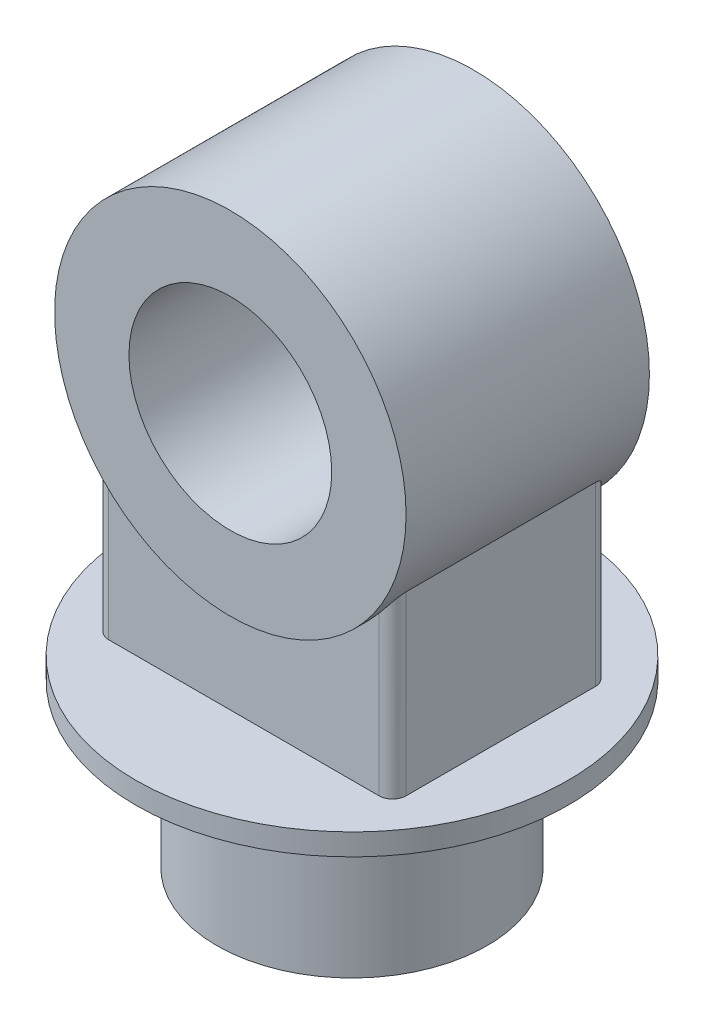
ISO-10303-21;
HEADER;
FILE_DESCRIPTION(('STEP AP214'),'2;1');
FILE_NAME('part.step','',(''),(''),'','','');
FILE_SCHEMA(('AUTOMOTIVE_DESIGN { 1 0 10303 214 1 1 1 1 }'));
ENDSEC;
DATA;
#1=APPLICATION_CONTEXT('core data for automotive mechanical design processes');
#2=APPLICATION_PROTOCOL_DEFINITION('international standard','automotive_design',2000,#1);
#3=PRODUCT_CONTEXT('',#1,'mechanical');
#4=PRODUCT('Part','Part','',(#3));
#5=PRODUCT_RELATED_PRODUCT_CATEGORY('part','',(#4));
#6=PRODUCT_DEFINITION_FORMATION('','',#4);
#7=PRODUCT_DEFINITION_CONTEXT('part definition',#1,'design');
#8=PRODUCT_DEFINITION('design','',#6,#7);
#9=PRODUCT_DEFINITION_SHAPE('','',#8);
#10=(LENGTH_UNIT() NAMED_UNIT(*) SI_UNIT(.MILLI.,.METRE.));
#11=(NAMED_UNIT(*) PLANE_ANGLE_UNIT() SI_UNIT($,.RADIAN.));
#12=(NAMED_UNIT(*) SI_UNIT($,.STERADIAN.) SOLID_ANGLE_UNIT());
#13=UNCERTAINTY_MEASURE_WITH_UNIT(LENGTH_MEASURE(1.E-05),#10,'distance_accuracy_value','');
#14=(GEOMETRIC_REPRESENTATION_CONTEXT(3) GLOBAL_UNCERTAINTY_ASSIGNED_CONTEXT((#13)) GLOBAL_UNIT_ASSIGNED_CONTEXT((#10,
#11,#12)) REPRESENTATION_CONTEXT('',''));
#15=CARTESIAN_POINT('',(0.,0.,0.));
#16=DIRECTION('',(0.,0.,1.));
#17=DIRECTION('',(1.,0.,0.));
#18=AXIS2_PLACEMENT_3D('',#15,#16,#17);
#19=CARTESIAN_POINT('',(0.,120.,0.));
#20=DIRECTION('',(0.,-1.,0.));
#21=DIRECTION('',(0.,0.,-1.));
#22=AXIS2_PLACEMENT_3D('',#19,#20,#21);
#23=CYLINDRICAL_SURFACE('',#22,100.);
#24=CARTESIAN_POINT('',(0.,120.,0.));
#25=DIRECTION('',(0.,1.,0.));
#26=DIRECTION('',(0.,0.,1.));
#27=AXIS2_PLACEMENT_3D('',#24,#25,#26);
#28=CIRCLE('',#27,100.);
#29=CARTESIAN_POINT('',(0.,120.,100.));
#30=VERTEX_POINT('',#29);
#31=EDGE_CURVE('E135',#30,#30,#28,.T.);
#32=ORIENTED_EDGE('',*,*,#31,.F.);
#33=EDGE_LOOP('',(#32));
#34=FACE_BOUND('',#33,.T.);
#35=CARTESIAN_POINT('',(0.,0.,0.));
#36=DIRECTION('',(0.,1.,0.));
#37=DIRECTION('',(0.,0.,1.));
#38=AXIS2_PLACEMENT_3D('',#35,#36,#37);
#39=CIRCLE('',#38,100.);
#40=CARTESIAN_POINT('',(0.,0.,100.));
#41=VERTEX_POINT('',#40);
#42=EDGE_CURVE('E209',#41,#41,#39,.T.);
#43=ORIENTED_EDGE('',*,*,#42,.T.);
#44=EDGE_LOOP('',(#43));
#45=FACE_BOUND('',#44,.T.);
#46=ADVANCED_FACE('F34',(#34,#45),#23,.T.);
#47=CARTESIAN_POINT('',(0.,0.,0.));
#48=DIRECTION('',(0.,1.,0.));
#49=DIRECTION('',(0.,0.,1.));
#50=AXIS2_PLACEMENT_3D('',#47,#48,#49);
#51=PLANE('',#50);
#52=ORIENTED_EDGE('',*,*,#42,.F.);
#53=EDGE_LOOP('',(#52));
#54=FACE_BOUND('',#53,.T.);
#55=ADVANCED_FACE('F197',(#54),#51,.F.);
#56=CARTESIAN_POINT('',(0.,136.,0.));
#57=DIRECTION('',(0.,-1.,0.));
#58=DIRECTION('',(0.,0.,-1.));
#59=AXIS2_PLACEMENT_3D('',#56,#57,#58);
#60=CYLINDRICAL_SURFACE('',#59,160.);
#61=CARTESIAN_POINT('',(0.,136.,0.));
#62=DIRECTION('',(0.,1.,0.));
#63=DIRECTION('',(0.,0.,1.));
#64=AXIS2_PLACEMENT_3D('',#61,#62,#63);
#65=CIRCLE('',#64,160.);
#66=CARTESIAN_POINT('',(0.,136.,160.));
#67=VERTEX_POINT('',#66);
#68=EDGE_CURVE('E210',#67,#67,#65,.T.);
#69=ORIENTED_EDGE('',*,*,#68,.F.);
#70=EDGE_LOOP('',(#69));
#71=FACE_BOUND('',#70,.T.);
#72=CARTESIAN_POINT('',(0.,120.,0.));
#73=DIRECTION('',(0.,1.,0.));
#74=DIRECTION('',(0.,0.,1.));
#75=AXIS2_PLACEMENT_3D('',#72,#73,#74);
#76=CIRCLE('',#75,160.);
#77=CARTESIAN_POINT('',(0.,120.,160.));
#78=VERTEX_POINT('',#77);
#79=EDGE_CURVE('E213',#78,#78,#76,.T.);
#80=ORIENTED_EDGE('',*,*,#79,.T.);
#81=EDGE_LOOP('',(#80));
#82=FACE_BOUND('',#81,.T.);
#83=ADVANCED_FACE('F202',(#71,#82),#60,.T.);
#84=CARTESIAN_POINT('',(0.,136.,0.));
#85=DIRECTION('',(0.,1.,0.));
#86=DIRECTION('',(0.,0.,1.));
#87=AXIS2_PLACEMENT_3D('',#84,#85,#86);
#88=PLANE('',#87);
#89=DIRECTION('',(0.,0.,-1.));
#90=VECTOR('',#89,1.);
#91=CARTESIAN_POINT('',(110.,136.,-80.));
#92=LINE('',#91,#90);
#93=CARTESIAN_POINT('',(110.,136.,70.));
#94=VERTEX_POINT('',#93);
#95=CARTESIAN_POINT('',(110.,136.,-70.));
#96=VERTEX_POINT('',#95);
#97=EDGE_CURVE('E217',#94,#96,#92,.T.);
#98=ORIENTED_EDGE('',*,*,#97,.F.);
#99=CARTESIAN_POINT('',(100.,136.,70.));
#100=DIRECTION('',(0.,1.,0.));
#101=DIRECTION('',(0.,0.,1.));
#102=AXIS2_PLACEMENT_3D('',#99,#100,#101);
#103=CIRCLE('',#102,10.);
#104=CARTESIAN_POINT('',(100.,136.,80.));
#105=VERTEX_POINT('',#104);
#106=EDGE_CURVE('E117',#94,#105,#103,.F.);
#107=ORIENTED_EDGE('',*,*,#106,.T.);
#108=DIRECTION('',(1.,0.,0.));
#109=VECTOR('',#108,1.);
#110=CARTESIAN_POINT('',(-110.,136.,80.));
#111=LINE('',#110,#109);
#112=CARTESIAN_POINT('',(-100.,136.,80.));
#113=VERTEX_POINT('',#112);
#114=EDGE_CURVE('E223',#113,#105,#111,.T.);
#115=ORIENTED_EDGE('',*,*,#114,.F.);
#116=CARTESIAN_POINT('',(-100.,136.,70.));
#117=DIRECTION('',(0.,1.,0.));
#118=DIRECTION('',(0.,0.,1.));
#119=AXIS2_PLACEMENT_3D('',#116,#117,#118);
#120=CIRCLE('',#119,10.);
#121=CARTESIAN_POINT('',(-110.,136.,70.));
#122=VERTEX_POINT('',#121);
#123=EDGE_CURVE('E48',#113,#122,#120,.F.);
#124=ORIENTED_EDGE('',*,*,#123,.T.);
#125=DIRECTION('',(0.,0.,1.));
#126=VECTOR('',#125,1.);
#127=CARTESIAN_POINT('',(-110.,136.,-80.));
#128=LINE('',#127,#126);
#129=CARTESIAN_POINT('',(-110.,136.,-70.));
#130=VERTEX_POINT('',#129);
#131=EDGE_CURVE('E226',#130,#122,#128,.T.);
#132=ORIENTED_EDGE('',*,*,#131,.F.);
#133=CARTESIAN_POINT('',(-100.,136.,-70.));
#134=DIRECTION('',(0.,1.,0.));
#135=DIRECTION('',(0.,0.,1.));
#136=AXIS2_PLACEMENT_3D('',#133,#134,#135);
#137=CIRCLE('',#136,10.);
#138=CARTESIAN_POINT('',(-100.,136.,-80.));
#139=VERTEX_POINT('',#138);
#140=EDGE_CURVE('E62',#130,#139,#137,.F.);
#141=ORIENTED_EDGE('',*,*,#140,.T.);
#142=DIRECTION('',(-1.,0.,0.));
#143=VECTOR('',#142,1.);
#144=CARTESIAN_POINT('',(-110.,136.,-80.));
#145=LINE('',#144,#143);
#146=CARTESIAN_POINT('',(100.,136.,-80.));
#147=VERTEX_POINT('',#146);
#148=EDGE_CURVE('E222',#147,#139,#145,.T.);
#149=ORIENTED_EDGE('',*,*,#148,.F.);
#150=CARTESIAN_POINT('',(100.,136.,-70.));
#151=DIRECTION('',(0.,1.,0.));
#152=DIRECTION('',(0.,0.,1.));
#153=AXIS2_PLACEMENT_3D('',#150,#151,#152);
#154=CIRCLE('',#153,10.);
#155=EDGE_CURVE('E118',#147,#96,#154,.F.);
#156=ORIENTED_EDGE('',*,*,#155,.T.);
#157=EDGE_LOOP('',(#98,#107,#115,#124,#132,#141,#149,#156));
#158=FACE_BOUND('',#157,.T.);
#159=ORIENTED_EDGE('',*,*,#68,.T.);
#160=EDGE_LOOP('',(#159));
#161=FACE_BOUND('',#160,.T.);
#162=ADVANCED_FACE('F278',(#158,#161),#88,.T.);
#163=CARTESIAN_POINT('',(0.,120.,0.));
#164=DIRECTION('',(0.,1.,0.));
#165=DIRECTION('',(0.,0.,1.));
#166=AXIS2_PLACEMENT_3D('',#163,#164,#165);
#167=PLANE('',#166);
#168=ORIENTED_EDGE('',*,*,#31,.T.);
#169=EDGE_LOOP('',(#168));
#170=FACE_BOUND('',#169,.T.);
#171=ORIENTED_EDGE('',*,*,#79,.F.);
#172=EDGE_LOOP('',(#171));
#173=FACE_BOUND('',#172,.T.);
#174=ADVANCED_FACE('F269',(#170,#173),#167,.F.);
#175=CARTESIAN_POINT('',(-110.,466.002,-80.));
#176=DIRECTION('',(0.,0.,1.));
#177=DIRECTION('',(1.,0.,0.));
#178=AXIS2_PLACEMENT_3D('',#175,#176,#177);
#179=PLANE('',#178);
#180=CARTESIAN_POINT('',(0.,336.,-80.));
#181=DIRECTION('',(0.,0.,1.));
#182=DIRECTION('',(1.,0.,0.));
#183=AXIS2_PLACEMENT_3D('',#180,#181,#182);
#184=CIRCLE('',#183,130.);
#185=CARTESIAN_POINT('',(100.,252.933761370819,-80.));
#186=VERTEX_POINT('',#185);
#187=CARTESIAN_POINT('',(-100.,252.933761370819,-80.));
#188=VERTEX_POINT('',#187);
#189=EDGE_CURVE('E110',#186,#188,#184,.F.);
#190=ORIENTED_EDGE('',*,*,#189,.F.);
#191=DIRECTION('',(0.,-1.,0.));
#192=VECTOR('',#191,1.);
#193=CARTESIAN_POINT('',(100.,466.002,-80.));
#194=LINE('',#193,#192);
#195=EDGE_CURVE('E124',#186,#147,#194,.T.);
#196=ORIENTED_EDGE('',*,*,#195,.T.);
#197=ORIENTED_EDGE('',*,*,#148,.T.);
#198=DIRECTION('',(0.,-1.,0.));
#199=VECTOR('',#198,1.);
#200=CARTESIAN_POINT('',(-100.,466.002,-80.));
#201=LINE('',#200,#199);
#202=EDGE_CURVE('E126',#139,#188,#201,.F.);
#203=ORIENTED_EDGE('',*,*,#202,.T.);
#204=EDGE_LOOP('',(#190,#196,#197,#203));
#205=FACE_BOUND('',#204,.T.);
#206=ADVANCED_FACE('F122',(#205),#179,.F.);
#207=CARTESIAN_POINT('',(110.,466.002,-80.));
#208=DIRECTION('',(-1.,0.,0.));
#209=DIRECTION('',(0.,0.,1.));
#210=AXIS2_PLACEMENT_3D('',#207,#208,#209);
#211=PLANE('',#210);
#212=ORIENTED_EDGE('',*,*,#97,.T.);
#213=DIRECTION('',(0.,-1.,0.));
#214=VECTOR('',#213,1.);
#215=CARTESIAN_POINT('',(110.,466.002,-70.));
#216=LINE('',#215,#214);
#217=CARTESIAN_POINT('',(110.,266.717967697245,-69.9999999999999));
#218=VERTEX_POINT('',#217);
#219=EDGE_CURVE('E133',#96,#218,#216,.F.);
#220=ORIENTED_EDGE('',*,*,#219,.T.);
#221=DIRECTION('',(0.,0.,-1.));
#222=VECTOR('',#221,1.);
#223=CARTESIAN_POINT('',(110.,266.717967697245,90.));
#224=LINE('',#223,#222);
#225=CARTESIAN_POINT('',(110.,266.717967697245,70.));
#226=VERTEX_POINT('',#225);
#227=EDGE_CURVE('E113',#226,#218,#224,.T.);
#228=ORIENTED_EDGE('',*,*,#227,.F.);
#229=DIRECTION('',(0.,-1.,0.));
#230=VECTOR('',#229,1.);
#231=CARTESIAN_POINT('',(110.,466.002,70.));
#232=LINE('',#231,#230);
#233=EDGE_CURVE('E130',#226,#94,#232,.T.);
#234=ORIENTED_EDGE('',*,*,#233,.T.);
#235=EDGE_LOOP('',(#212,#220,#228,#234));
#236=FACE_BOUND('',#235,.T.);
#237=ADVANCED_FACE('F268',(#236),#211,.F.);
#238=CARTESIAN_POINT('',(-110.,466.002,-80.));
#239=DIRECTION('',(1.,0.,0.));
#240=DIRECTION('',(0.,0.,-1.));
#241=AXIS2_PLACEMENT_3D('',#238,#239,#240);
#242=PLANE('',#241);
#243=DIRECTION('',(0.,0.,-1.));
#244=VECTOR('',#243,1.);
#245=CARTESIAN_POINT('',(-110.,266.717967697245,90.));
#246=LINE('',#245,#244);
#247=CARTESIAN_POINT('',(-110.,266.717967697245,-70.));
#248=VERTEX_POINT('',#247);
#249=CARTESIAN_POINT('',(-110.,266.717967697245,70.));
#250=VERTEX_POINT('',#249);
#251=EDGE_CURVE('E127',#248,#250,#246,.F.);
#252=ORIENTED_EDGE('',*,*,#251,.F.);
#253=DIRECTION('',(0.,-1.,0.));
#254=VECTOR('',#253,1.);
#255=CARTESIAN_POINT('',(-110.,466.002,-70.));
#256=LINE('',#255,#254);
#257=EDGE_CURVE('E147',#248,#130,#256,.T.);
#258=ORIENTED_EDGE('',*,*,#257,.T.);
#259=ORIENTED_EDGE('',*,*,#131,.T.);
#260=DIRECTION('',(0.,-1.,0.));
#261=VECTOR('',#260,1.);
#262=CARTESIAN_POINT('',(-110.,466.002,70.));
#263=LINE('',#262,#261);
#264=EDGE_CURVE('E145',#122,#250,#263,.F.);
#265=ORIENTED_EDGE('',*,*,#264,.T.);
#266=EDGE_LOOP('',(#252,#258,#259,#265));
#267=FACE_BOUND('',#266,.T.);
#268=ADVANCED_FACE('F187',(#267),#242,.F.);
#269=CARTESIAN_POINT('',(-110.,466.002,80.));
#270=DIRECTION('',(0.,0.,-1.));
#271=DIRECTION('',(-1.,0.,0.));
#272=AXIS2_PLACEMENT_3D('',#269,#270,#271);
#273=PLANE('',#272);
#274=ORIENTED_EDGE('',*,*,#114,.T.);
#275=DIRECTION('',(0.,-1.,0.));
#276=VECTOR('',#275,1.);
#277=CARTESIAN_POINT('',(100.,466.002,80.));
#278=LINE('',#277,#276);
#279=CARTESIAN_POINT('',(100.,252.933761370819,80.));
#280=VERTEX_POINT('',#279);
#281=EDGE_CURVE('E143',#105,#280,#278,.F.);
#282=ORIENTED_EDGE('',*,*,#281,.T.);
#283=CARTESIAN_POINT('',(0.,336.,80.));
#284=DIRECTION('',(0.,0.,-1.));
#285=DIRECTION('',(-1.,0.,0.));
#286=AXIS2_PLACEMENT_3D('',#283,#284,#285);
#287=CIRCLE('',#286,130.);
#288=CARTESIAN_POINT('',(-100.,252.933761370819,80.));
#289=VERTEX_POINT('',#288);
#290=EDGE_CURVE('E189',#289,#280,#287,.F.);
#291=ORIENTED_EDGE('',*,*,#290,.F.);
#292=DIRECTION('',(0.,-1.,0.));
#293=VECTOR('',#292,1.);
#294=CARTESIAN_POINT('',(-100.,466.002,80.));
#295=LINE('',#294,#293);
#296=EDGE_CURVE('E140',#289,#113,#295,.T.);
#297=ORIENTED_EDGE('',*,*,#296,.T.);
#298=EDGE_LOOP('',(#274,#282,#291,#297));
#299=FACE_BOUND('',#298,.T.);
#300=ADVANCED_FACE('F254',(#299),#273,.F.);
#301=CARTESIAN_POINT('',(0.,336.,90.));
#302=DIRECTION('',(0.,0.,-1.));
#303=DIRECTION('',(-1.,0.,0.));
#304=AXIS2_PLACEMENT_3D('',#301,#302,#303);
#305=CYLINDRICAL_SURFACE('',#304,130.);
#306=CARTESIAN_POINT('',(0.,336.,90.));
#307=DIRECTION('',(0.,0.,1.));
#308=DIRECTION('',(1.,0.,0.));
#309=AXIS2_PLACEMENT_3D('',#306,#307,#308);
#310=CIRCLE('',#309,130.);
#311=CARTESIAN_POINT('',(130.,336.,90.));
#312=VERTEX_POINT('',#311);
#313=EDGE_CURVE('E219',#312,#312,#310,.T.);
#314=ORIENTED_EDGE('',*,*,#313,.F.);
#315=EDGE_LOOP('',(#314));
#316=FACE_BOUND('',#315,.T.);
#317=CARTESIAN_POINT('',(0.,336.,-90.));
#318=DIRECTION('',(0.,0.,1.));
#319=DIRECTION('',(1.,0.,0.));
#320=AXIS2_PLACEMENT_3D('',#317,#318,#319);
#321=CIRCLE('',#320,130.);
#322=CARTESIAN_POINT('',(130.,336.,-90.));
#323=VERTEX_POINT('',#322);
#324=EDGE_CURVE('E231',#323,#323,#321,.T.);
#325=ORIENTED_EDGE('',*,*,#324,.T.);
#326=EDGE_LOOP('',(#325));
#327=FACE_BOUND('',#326,.T.);
#328=ORIENTED_EDGE('',*,*,#290,.T.);
#329=CARTESIAN_POINT('',(100.,252.933761370819,80.));
#330=CARTESIAN_POINT('',(100.223611151915,253.202952503255,79.9999830665315));
#331=CARTESIAN_POINT('',(100.446118360057,253.473036166024,79.9924995885085));
#332=CARTESIAN_POINT('',(100.888548742496,254.014496760122,79.9629173131463));
#333=CARTESIAN_POINT('',(101.108472043759,254.285873626978,79.9408192370116));
#334=CARTESIAN_POINT('',(101.545586290072,254.829711400373,79.8822979337703));
#335=CARTESIAN_POINT('',(101.76277446753,255.102173087004,79.8458612385231));
#336=CARTESIAN_POINT('',(102.193849033468,255.647413797012,79.7588609087488));
#337=CARTESIAN_POINT('',(102.407735374993,255.920192824843,79.7082970735217));
#338=CARTESIAN_POINT('',(103.048408055095,256.74400885936,79.5343891784366));
#339=CARTESIAN_POINT('',(103.469748368072,257.294974230618,79.3894263280958));
#340=CARTESIAN_POINT('',(104.088382224678,258.117224843771,79.1288060997197));
#341=CARTESIAN_POINT('',(104.292337034927,258.39057162742,79.0347525474724));
#342=CARTESIAN_POINT('',(104.695498702643,258.935304765081,78.8319429710982));
#343=CARTESIAN_POINT('',(104.894706004332,259.206691300842,78.7231883289499));
#344=CARTESIAN_POINT('',(105.336170271764,259.812965668139,78.4620472638272));
#345=CARTESIAN_POINT('',(105.577006541077,260.147108038148,78.3055009036513));
#346=CARTESIAN_POINT('',(106.04966094987,260.809343252621,77.967808626391));
#347=CARTESIAN_POINT('',(106.281479043935,261.137436066616,77.7866625854444));
#348=CARTESIAN_POINT('',(106.734152264033,261.784259610706,77.3986376161628));
#349=CARTESIAN_POINT('',(106.955036134368,262.103013877598,77.1918317878757));
#350=CARTESIAN_POINT('',(107.384708325122,262.728803605627,76.749894392022));
#351=CARTESIAN_POINT('',(107.593501627276,263.035843875289,76.5147746155492));
#352=CARTESIAN_POINT('',(107.921279015409,263.522080966666,76.1068757916446));
#353=CARTESIAN_POINT('',(108.044709884718,263.706240813682,75.9435605188263));
#354=CARTESIAN_POINT('',(108.284949666933,264.066582834907,75.6038296157538));
#355=CARTESIAN_POINT('',(108.401760304956,264.242767084986,75.4274174262629));
#356=CARTESIAN_POINT('',(108.627683741988,264.585236991633,75.0605773993747));
#357=CARTESIAN_POINT('',(108.736797961361,264.751524473746,74.8701521613913));
#358=CARTESIAN_POINT('',(108.945874410432,265.071634412635,74.4745306992528));
#359=CARTESIAN_POINT('',(109.04583974995,265.225461102935,74.2693395369045));
#360=CARTESIAN_POINT('',(109.274660386151,265.579056080623,73.7536743100227));
#361=CARTESIAN_POINT('',(109.398046362816,265.771031349643,73.4351396850742));
#362=CARTESIAN_POINT('',(109.561336457207,266.026263049992,72.9345418523035));
#363=CARTESIAN_POINT('',(109.612072269395,266.105785634321,72.7641622498837));
#364=CARTESIAN_POINT('',(109.705421847597,266.25239837099,72.4160328323222));
#365=CARTESIAN_POINT('',(109.748040656091,266.319496241142,72.2382876769633));
#366=CARTESIAN_POINT('',(109.820262744001,266.433384610412,71.8947331689276));
#367=CARTESIAN_POINT('',(109.850752312767,266.481551609067,71.729567610939));
#368=CARTESIAN_POINT('',(109.903691363628,266.565274678987,71.3948451418076));
#369=CARTESIAN_POINT('',(109.926143541964,266.600834979285,71.2252897238033));
#370=CARTESIAN_POINT('',(109.962659042777,266.658707696818,70.8807814271977));
#371=CARTESIAN_POINT('',(109.976613864032,266.680848750137,70.7057875562757));
#372=CARTESIAN_POINT('',(109.99061964662,266.703076138542,70.4419386674803));
#373=CARTESIAN_POINT('',(109.99413386492,266.708654625171,70.3536902139711));
#374=CARTESIAN_POINT('',(109.998824989492,266.716102079046,70.1769662160102));
#375=CARTESIAN_POINT('',(110.000001659485,266.717970671296,70.088490649507));
#376=CARTESIAN_POINT('',(110.,266.717967697245,70.));
#377=B_SPLINE_CURVE_WITH_KNOTS('',3,(#329,#330,#331,#332,#333,#334,#335,#336,#337,#338,#339,
#340,#341,#342,#343,#344,#345,#346,#347,#348,#349,#350,#351,#352,#353,#354,#355,#356,#357,#358,
#359,#360,#361,#362,#363,#364,#365,#366,#367,#368,#369,#370,#371,#372,#373,#374,#375,#376),
.UNSPECIFIED.,.F.,.F.,(4,2,2,2,2,2,2,2,2,2,2,2,2,2,2,2,2,2,2,2,2,2,2,4),(0.,1.04974156507776,
2.09943133114567,3.15010942417265,4.20080244462031,6.32356278933861,7.38465211465335,
8.44564176134501,9.76677685539397,11.087918601761,12.4053795382949,13.7222937149077,
14.5479419827463,15.3733741023698,16.1986534888326,17.023651302289,18.194686650492,
18.7783719827905,19.3616935243415,19.8852298594992,20.4085904030381,20.9385006934629,
21.2038887699912,21.4693036704869),.UNSPECIFIED.);
#378=EDGE_CURVE('E171',#280,#226,#377,.T.);
#379=ORIENTED_EDGE('',*,*,#378,.T.);
#380=ORIENTED_EDGE('',*,*,#227,.T.);
#381=CARTESIAN_POINT('',(110.,266.717967697245,-70.));
#382=CARTESIAN_POINT('',(110.000033683462,266.718025852698,-70.1614230595313));
#383=CARTESIAN_POINT('',(109.996092792414,266.711764254296,-70.3228118197691));
#384=CARTESIAN_POINT('',(109.980519982779,266.687045880384,-70.6441123999957));
#385=CARTESIAN_POINT('',(109.968896213713,266.668602027069,-70.8040256031146));
#386=CARTESIAN_POINT('',(109.938376398954,266.620217986395,-71.1196424551221));
#387=CARTESIAN_POINT('',(109.919558261622,266.590400967593,-71.2753727040436));
#388=CARTESIAN_POINT('',(109.875071558334,266.52000006118,-71.5834085562726));
#389=CARTESIAN_POINT('',(109.849400846184,266.479412800404,-71.7357130704249));
#390=CARTESIAN_POINT('',(109.784772267017,266.377386983169,-72.0722520040974));
#391=CARTESIAN_POINT('',(109.744103525393,266.313281105856,-72.2553511890568));
#392=CARTESIAN_POINT('',(109.654040532803,266.17165023193,-72.6141464391851));
#393=CARTESIAN_POINT('',(109.604640075501,266.094115691273,-72.7898371277865));
#394=CARTESIAN_POINT('',(109.497968805892,265.927147418338,-73.1338723913451));
#395=CARTESIAN_POINT('',(109.440667457039,265.837667562915,-73.302184951541));
#396=CARTESIAN_POINT('',(109.319341126161,265.648779195145,-73.6304969218558));
#397=CARTESIAN_POINT('',(109.25531768694,265.549372961282,-73.7904982269664));
#398=CARTESIAN_POINT('',(109.085069343255,265.28590129292,-74.1868876463209));
#399=CARTESIAN_POINT('',(108.974781990569,265.115997241409,-74.4176642111939));
#400=CARTESIAN_POINT('',(108.742772943656,264.76058359918,-74.8607110351426));
#401=CARTESIAN_POINT('',(108.621044869784,264.575065307649,-75.072970840064));
#402=CARTESIAN_POINT('',(108.36794946479,264.19164129378,-75.4804206329534));
#403=CARTESIAN_POINT('',(108.236568322626,263.993717884812,-75.6755852518652));
#404=CARTESIAN_POINT('',(107.965814499919,263.588382733387,-76.0497203250661));
#405=CARTESIAN_POINT('',(107.826442440892,263.380971729107,-76.2286920360201));
#406=CARTESIAN_POINT('',(107.56145650763,262.989174407744,-76.5468161797372));
#407=CARTESIAN_POINT('',(107.436764821801,262.805791987749,-76.6879854690673));
#408=CARTESIAN_POINT('',(107.182869679799,262.434497987953,-76.9599552926783));
#409=CARTESIAN_POINT('',(107.053665586411,262.24658576965,-77.0907543539385));
#410=CARTESIAN_POINT('',(106.659844344167,261.677121003612,-77.4685356621901));
#411=CARTESIAN_POINT('',(106.389102445143,261.289965080353,-77.700802481696));
#412=CARTESIAN_POINT('',(105.833418194947,260.504836154638,-78.1298636316309));
#413=CARTESIAN_POINT('',(105.548442441802,260.106838810795,-78.3265689888295));
#414=CARTESIAN_POINT('',(104.96676628824,259.304344779382,-78.6860846955171));
#415=CARTESIAN_POINT('',(104.670068038633,258.899849292081,-78.8489012287858));
#416=CARTESIAN_POINT('',(104.024574509401,258.030646711215,-79.1623550419402));
#417=CARTESIAN_POINT('',(103.674248758637,257.565348460988,-79.3081944572228));
#418=CARTESIAN_POINT('',(102.961876677953,256.632523338709,-79.558756520093));
#419=CARTESIAN_POINT('',(102.599828734006,256.16499616738,-79.6634734792563));
#420=CARTESIAN_POINT('',(102.051092736822,255.466397204689,-79.7891645729387));
#421=CARTESIAN_POINT('',(101.868137468165,255.235094848973,-79.8257282191264));
#422=CARTESIAN_POINT('',(101.499966150616,254.77288550036,-79.8886289353229));
#423=CARTESIAN_POINT('',(101.314750133026,254.541978502041,-79.9149661467555));
#424=CARTESIAN_POINT('',(100.942320486513,254.080919722901,-79.9572665465168));
#425=CARTESIAN_POINT('',(100.755107350153,253.850767773367,-79.9732322353467));
#426=CARTESIAN_POINT('',(100.378860262163,253.391449185777,-79.9945948234744));
#427=CARTESIAN_POINT('',(100.189826234412,253.162282589497,-79.9999912789888));
#428=CARTESIAN_POINT('',(100.,252.933761370819,-80.));
#429=B_SPLINE_CURVE_WITH_KNOTS('',3,(#381,#382,#383,#384,#385,#386,#387,#388,#389,#390,#391,
#392,#393,#394,#395,#396,#397,#398,#399,#400,#401,#402,#403,#404,#405,#406,#407,#408,#409,#410,
#411,#412,#413,#414,#415,#416,#417,#418,#419,#420,#421,#422,#423,#424,#425,#426,#427,#428),
.UNSPECIFIED.,.F.,.F.,(4,2,2,2,2,2,2,2,2,2,2,2,2,2,2,2,2,2,2,2,2,2,2,4),(0.,0.484045005923085,
0.967577389145422,1.44601544684505,1.92460352520315,2.51835043890469,3.11252108624078,
3.7090561398874,4.30545457926273,5.22516595363371,6.14539326092319,7.06696382284185,
7.98846280401959,8.77680092000532,9.56525081419885,11.1426900482286,12.7240229357796,
14.3050670200468,16.1047501551827,17.9046821508917,18.7960435003637,19.6873925225409,
20.5785265668947,21.4696980275819),.UNSPECIFIED.);
#430=EDGE_CURVE('E106',#218,#186,#429,.T.);
#431=ORIENTED_EDGE('',*,*,#430,.T.);
#432=ORIENTED_EDGE('',*,*,#189,.T.);
#433=CARTESIAN_POINT('',(-100.,252.933761370819,-80.));
#434=CARTESIAN_POINT('',(-100.223611151915,253.202952503255,-79.9999830665315));
#435=CARTESIAN_POINT('',(-100.446118360057,253.473036166024,-79.9924995885085));
#436=CARTESIAN_POINT('',(-100.888548742496,254.014496760122,-79.9629173131463));
#437=CARTESIAN_POINT('',(-101.10847204376,254.285873626978,-79.9408192370116));
#438=CARTESIAN_POINT('',(-101.545586290072,254.829711400373,-79.8822979337703));
#439=CARTESIAN_POINT('',(-101.76277446753,255.102173087004,-79.8458612385231));
#440=CARTESIAN_POINT('',(-102.193849033468,255.647413797012,-79.7588609087488));
#441=CARTESIAN_POINT('',(-102.407735374993,255.920192824843,-79.7082970735217));
#442=CARTESIAN_POINT('',(-103.048408055095,256.74400885936,-79.5343891784366));
#443=CARTESIAN_POINT('',(-103.469748368072,257.294974230618,-79.3894263280958));
#444=CARTESIAN_POINT('',(-104.088382224678,258.117224843771,-79.1288060997197));
#445=CARTESIAN_POINT('',(-104.292337034927,258.39057162742,-79.0347525474724));
#446=CARTESIAN_POINT('',(-104.695498702643,258.935304765081,-78.8319429710982));
#447=CARTESIAN_POINT('',(-104.894706004332,259.206691300842,-78.7231883289499));
#448=CARTESIAN_POINT('',(-105.336170271764,259.812965668139,-78.4620472638272));
#449=CARTESIAN_POINT('',(-105.577006541077,260.147108038148,-78.3055009036513));
#450=CARTESIAN_POINT('',(-106.049660949871,260.809343252621,-77.967808626391));
#451=CARTESIAN_POINT('',(-106.281479043935,261.137436066616,-77.7866625854444));
#452=CARTESIAN_POINT('',(-106.734152264033,261.784259610706,-77.3986376161628));
#453=CARTESIAN_POINT('',(-106.955036134368,262.103013877599,-77.1918317878757));
#454=CARTESIAN_POINT('',(-107.384708325122,262.728803605627,-76.749894392022));
#455=CARTESIAN_POINT('',(-107.593501627276,263.035843875289,-76.5147746155492));
#456=CARTESIAN_POINT('',(-107.921279015409,263.522080966667,-76.1068757916446));
#457=CARTESIAN_POINT('',(-108.044709884718,263.706240813682,-75.9435605188263));
#458=CARTESIAN_POINT('',(-108.284949666933,264.066582834907,-75.6038296157538));
#459=CARTESIAN_POINT('',(-108.401760304956,264.242767084987,-75.4274174262628));
#460=CARTESIAN_POINT('',(-108.627683741988,264.585236991633,-75.0605773993746));
#461=CARTESIAN_POINT('',(-108.736797961361,264.751524473746,-74.8701521613912));
#462=CARTESIAN_POINT('',(-108.945874410432,265.071634412635,-74.4745306992528));
#463=CARTESIAN_POINT('',(-109.04583974995,265.225461102935,-74.2693395369045));
#464=CARTESIAN_POINT('',(-109.274660386151,265.579056080623,-73.7536743100227));
#465=CARTESIAN_POINT('',(-109.398046362816,265.771031349643,-73.4351396850742));
#466=CARTESIAN_POINT('',(-109.561336457207,266.026263049993,-72.9345418523035));
#467=CARTESIAN_POINT('',(-109.612072269395,266.105785634321,-72.7641622498836));
#468=CARTESIAN_POINT('',(-109.705421847597,266.25239837099,-72.4160328323222));
#469=CARTESIAN_POINT('',(-109.748040656091,266.319496241142,-72.2382876769632));
#470=CARTESIAN_POINT('',(-109.820262744001,266.433384610412,-71.8947331689276));
#471=CARTESIAN_POINT('',(-109.850752312767,266.481551609067,-71.729567610939));
#472=CARTESIAN_POINT('',(-109.903691363628,266.565274678988,-71.3948451418076));
#473=CARTESIAN_POINT('',(-109.926143541964,266.600834979285,-71.2252897238033));
#474=CARTESIAN_POINT('',(-109.962659042777,266.658707696818,-70.8807814271977));
#475=CARTESIAN_POINT('',(-109.976613864032,266.680848750137,-70.7057875562757));
#476=CARTESIAN_POINT('',(-109.99061964662,266.703076138542,-70.4419386674803));
#477=CARTESIAN_POINT('',(-109.99413386492,266.708654625172,-70.3536902139711));
#478=CARTESIAN_POINT('',(-109.998824989492,266.716102079046,-70.1769662160102));
#479=CARTESIAN_POINT('',(-110.000001659485,266.717970671296,-70.088490649507));
#480=CARTESIAN_POINT('',(-110.,266.717967697245,-70.));
#481=B_SPLINE_CURVE_WITH_KNOTS('',3,(#433,#434,#435,#436,#437,#438,#439,#440,#441,#442,#443,
#444,#445,#446,#447,#448,#449,#450,#451,#452,#453,#454,#455,#456,#457,#458,#459,#460,#461,#462,
#463,#464,#465,#466,#467,#468,#469,#470,#471,#472,#473,#474,#475,#476,#477,#478,#479,#480),
.UNSPECIFIED.,.F.,.F.,(4,2,2,2,2,2,2,2,2,2,2,2,2,2,2,2,2,2,2,2,2,2,2,4),(0.,1.04974156507777,
2.09943133114573,3.15010942417271,4.20080244462036,6.32356278933865,7.38465211465328,
8.445641761345,9.76677685539396,11.087918601761,12.4053795382949,13.7222937149077,
14.5479419827464,15.3733741023699,16.1986534888326,17.023651302289,18.1946866504921,
18.7783719827906,19.3616935243416,19.8852298594993,20.4085904030381,20.9385006934629,
21.2038887699913,21.4693036704869),.UNSPECIFIED.);
#482=EDGE_CURVE('E178',#188,#248,#481,.T.);
#483=ORIENTED_EDGE('',*,*,#482,.T.);
#484=ORIENTED_EDGE('',*,*,#251,.T.);
#485=CARTESIAN_POINT('',(-110.,266.717967697245,70.));
#486=CARTESIAN_POINT('',(-110.000033683462,266.718025852698,70.1614230595313));
#487=CARTESIAN_POINT('',(-109.996092792414,266.711764254296,70.3228118197691));
#488=CARTESIAN_POINT('',(-109.980519982779,266.687045880384,70.6441123999957));
#489=CARTESIAN_POINT('',(-109.968896213713,266.668602027069,70.8040256031146));
#490=CARTESIAN_POINT('',(-109.938376398954,266.620217986395,71.1196424551221));
#491=CARTESIAN_POINT('',(-109.919558261622,266.590400967593,71.2753727040436));
#492=CARTESIAN_POINT('',(-109.875071558334,266.52000006118,71.5834085562726));
#493=CARTESIAN_POINT('',(-109.849400846184,266.479412800404,71.7357130704249));
#494=CARTESIAN_POINT('',(-109.784772267017,266.377386983169,72.0722520040974));
#495=CARTESIAN_POINT('',(-109.744103525393,266.313281105856,72.2553511890568));
#496=CARTESIAN_POINT('',(-109.654040532803,266.17165023193,72.6141464391851));
#497=CARTESIAN_POINT('',(-109.604640075501,266.094115691273,72.7898371277865));
#498=CARTESIAN_POINT('',(-109.497968805892,265.927147418338,73.133872391345));
#499=CARTESIAN_POINT('',(-109.440667457039,265.837667562915,73.302184951541));
#500=CARTESIAN_POINT('',(-109.319341126161,265.648779195145,73.6304969218558));
#501=CARTESIAN_POINT('',(-109.25531768694,265.549372961282,73.7904982269664));
#502=CARTESIAN_POINT('',(-109.085069343255,265.28590129292,74.1868876463209));
#503=CARTESIAN_POINT('',(-108.974781990569,265.115997241409,74.4176642111939));
#504=CARTESIAN_POINT('',(-108.742772943656,264.76058359918,74.8607110351426));
#505=CARTESIAN_POINT('',(-108.621044869784,264.575065307649,75.072970840064));
#506=CARTESIAN_POINT('',(-108.36794946479,264.19164129378,75.4804206329535));
#507=CARTESIAN_POINT('',(-108.236568322626,263.993717884812,75.6755852518652));
#508=CARTESIAN_POINT('',(-107.965814499919,263.588382733388,76.0497203250662));
#509=CARTESIAN_POINT('',(-107.826442440892,263.380971729107,76.2286920360201));
#510=CARTESIAN_POINT('',(-107.56145650763,262.989174407744,76.5468161797372));
#511=CARTESIAN_POINT('',(-107.436764821801,262.805791987749,76.6879854690674));
#512=CARTESIAN_POINT('',(-107.182869679799,262.434497987953,76.9599552926783));
#513=CARTESIAN_POINT('',(-107.053665586411,262.24658576965,77.0907543539386));
#514=CARTESIAN_POINT('',(-106.659844344167,261.677121003612,77.4685356621902));
#515=CARTESIAN_POINT('',(-106.389102445143,261.289965080353,77.7008024816961));
#516=CARTESIAN_POINT('',(-105.833418194947,260.504836154638,78.129863631631));
#517=CARTESIAN_POINT('',(-105.548442441802,260.106838810795,78.3265689888296));
#518=CARTESIAN_POINT('',(-104.96676628824,259.304344779382,78.6860846955171));
#519=CARTESIAN_POINT('',(-104.670068038633,258.899849292081,78.8489012287858));
#520=CARTESIAN_POINT('',(-104.024574509401,258.030646711215,79.1623550419402));
#521=CARTESIAN_POINT('',(-103.674248758637,257.565348460988,79.3081944572228));
#522=CARTESIAN_POINT('',(-102.961876677953,256.632523338709,79.558756520093));
#523=CARTESIAN_POINT('',(-102.599828734006,256.16499616738,79.6634734792563));
#524=CARTESIAN_POINT('',(-102.051092736822,255.466397204689,79.7891645729388));
#525=CARTESIAN_POINT('',(-101.868137468165,255.235094848973,79.8257282191264));
#526=CARTESIAN_POINT('',(-101.499966150616,254.77288550036,79.8886289353229));
#527=CARTESIAN_POINT('',(-101.314750133026,254.541978502041,79.9149661467555));
#528=CARTESIAN_POINT('',(-100.942320486513,254.080919722901,79.9572665465168));
#529=CARTESIAN_POINT('',(-100.755107350153,253.850767773367,79.9732322353467));
#530=CARTESIAN_POINT('',(-100.378860262163,253.391449185777,79.9945948234744));
#531=CARTESIAN_POINT('',(-100.189826234412,253.162282589497,79.9999912789888));
#532=CARTESIAN_POINT('',(-100.,252.933761370819,80.));
#533=B_SPLINE_CURVE_WITH_KNOTS('',3,(#485,#486,#487,#488,#489,#490,#491,#492,#493,#494,#495,
#496,#497,#498,#499,#500,#501,#502,#503,#504,#505,#506,#507,#508,#509,#510,#511,#512,#513,#514,
#515,#516,#517,#518,#519,#520,#521,#522,#523,#524,#525,#526,#527,#528,#529,#530,#531,#532),
.UNSPECIFIED.,.F.,.F.,(4,2,2,2,2,2,2,2,2,2,2,2,2,2,2,2,2,2,2,2,2,2,2,4),(0.,0.484045005923072,
0.967577389145423,1.44601544684507,1.92460352520313,2.51835043890467,3.11252108624077,
3.7090561398874,4.30545457926274,5.22516595363375,6.14539326092329,7.06696382284192,
7.98846280401962,8.77680092000541,9.56525081419893,11.1426900482287,12.7240229357797,
14.305067020047,16.1047501551829,17.9046821508918,18.7960435003637,19.6873925225409,
20.5785265668947,21.4696980275819),.UNSPECIFIED.);
#534=EDGE_CURVE('E11',#250,#289,#533,.T.);
#535=ORIENTED_EDGE('',*,*,#534,.T.);
#536=EDGE_LOOP('',(#328,#379,#380,#431,#432,#483,#484,#535));
#537=FACE_BOUND('',#536,.T.);
#538=ADVANCED_FACE('F109',(#316,#327,#537),#305,.T.);
#539=CARTESIAN_POINT('',(0.,336.,90.));
#540=DIRECTION('',(0.,0.,-1.));
#541=DIRECTION('',(-1.,0.,0.));
#542=AXIS2_PLACEMENT_3D('',#539,#540,#541);
#543=CYLINDRICAL_SURFACE('',#542,75.);
#544=CARTESIAN_POINT('',(0.,336.,90.));
#545=DIRECTION('',(0.,0.,1.));
#546=DIRECTION('',(1.,0.,0.));
#547=AXIS2_PLACEMENT_3D('',#544,#545,#546);
#548=CIRCLE('',#547,75.);
#549=CARTESIAN_POINT('',(-75.,336.,90.));
#550=VERTEX_POINT('',#549);
#551=EDGE_CURVE('E234',#550,#550,#548,.T.);
#552=CARTESIAN_POINT('',(0.,336.,-90.));
#553=DIRECTION('',(0.,0.,1.));
#554=DIRECTION('',(1.,0.,0.));
#555=AXIS2_PLACEMENT_3D('',#552,#553,#554);
#556=CIRCLE('',#555,75.);
#557=CARTESIAN_POINT('',(-75.,336.,-90.));
#558=VERTEX_POINT('',#557);
#559=EDGE_CURVE('E235',#558,#558,#556,.T.);
#560=CARTESIAN_POINT('',(-75.,336.,90.));
#561=CARTESIAN_POINT('',(-75.,336.,88.125));
#562=CARTESIAN_POINT('',(-75.,336.,86.25));
#563=CARTESIAN_POINT('',(-75.,336.,82.5));
#564=CARTESIAN_POINT('',(-75.,336.,80.625));
#565=CARTESIAN_POINT('',(-75.,336.,76.875));
#566=CARTESIAN_POINT('',(-75.,336.,75.));
#567=CARTESIAN_POINT('',(-75.,336.,71.25));
#568=CARTESIAN_POINT('',(-75.,336.,69.375));
#569=CARTESIAN_POINT('',(-75.,336.,65.625));
#570=CARTESIAN_POINT('',(-75.,336.,63.75));
#571=CARTESIAN_POINT('',(-75.,336.,60.));
#572=CARTESIAN_POINT('',(-75.,336.,58.125));
#573=CARTESIAN_POINT('',(-75.,336.,54.375));
#574=CARTESIAN_POINT('',(-75.,336.,52.5));
#575=CARTESIAN_POINT('',(-75.,336.,48.75));
#576=CARTESIAN_POINT('',(-75.,336.,46.875));
#577=CARTESIAN_POINT('',(-75.,336.,43.125));
#578=CARTESIAN_POINT('',(-75.,336.,41.25));
#579=CARTESIAN_POINT('',(-75.,336.,37.5));
#580=CARTESIAN_POINT('',(-75.,336.,35.625));
#581=CARTESIAN_POINT('',(-75.,336.,31.875));
#582=CARTESIAN_POINT('',(-75.,336.,30.));
#583=CARTESIAN_POINT('',(-75.,336.,26.25));
#584=CARTESIAN_POINT('',(-75.,336.,24.375));
#585=CARTESIAN_POINT('',(-75.,336.,20.625));
#586=CARTESIAN_POINT('',(-75.,336.,18.75));
#587=CARTESIAN_POINT('',(-75.,336.,15.));
#588=CARTESIAN_POINT('',(-75.,336.,13.125));
#589=CARTESIAN_POINT('',(-75.,336.,9.37499999999998));
#590=CARTESIAN_POINT('',(-75.,336.,7.49999999999998));
#591=CARTESIAN_POINT('',(-75.,336.,3.74999999999998));
#592=CARTESIAN_POINT('',(-75.,336.,1.87499999999997));
#593=CARTESIAN_POINT('',(-75.,336.,-1.87500000000003));
#594=CARTESIAN_POINT('',(-75.,336.,-3.75000000000003));
#595=CARTESIAN_POINT('',(-75.,336.,-7.50000000000003));
#596=CARTESIAN_POINT('',(-75.,336.,-9.37500000000004));
#597=CARTESIAN_POINT('',(-75.,336.,-13.125));
#598=CARTESIAN_POINT('',(-75.,336.,-15.));
#599=CARTESIAN_POINT('',(-75.,336.,-18.75));
#600=CARTESIAN_POINT('',(-75.,336.,-20.625));
#601=CARTESIAN_POINT('',(-75.,336.,-24.375));
#602=CARTESIAN_POINT('',(-75.,336.,-26.25));
#603=CARTESIAN_POINT('',(-75.,336.,-30.));
#604=CARTESIAN_POINT('',(-75.,336.,-31.875));
#605=CARTESIAN_POINT('',(-75.,336.,-35.625));
#606=CARTESIAN_POINT('',(-75.,336.,-37.5));
#607=CARTESIAN_POINT('',(-75.,336.,-41.25));
#608=CARTESIAN_POINT('',(-75.,336.,-43.125));
#609=CARTESIAN_POINT('',(-75.,336.,-46.875));
#610=CARTESIAN_POINT('',(-75.,336.,-48.75));
#611=CARTESIAN_POINT('',(-75.,336.,-52.5));
#612=CARTESIAN_POINT('',(-75.,336.,-54.375));
#613=CARTESIAN_POINT('',(-75.,336.,-58.125));
#614=CARTESIAN_POINT('',(-75.,336.,-60.));
#615=CARTESIAN_POINT('',(-75.,336.,-63.75));
#616=CARTESIAN_POINT('',(-75.,336.,-65.625));
#617=CARTESIAN_POINT('',(-75.,336.,-69.375));
#618=CARTESIAN_POINT('',(-75.,336.,-71.25));
#619=CARTESIAN_POINT('',(-75.,336.,-75.));
#620=CARTESIAN_POINT('',(-75.,336.,-76.875));
#621=CARTESIAN_POINT('',(-75.,336.,-80.625));
#622=CARTESIAN_POINT('',(-75.,336.,-82.5));
#623=CARTESIAN_POINT('',(-75.,336.,-86.25));
#624=CARTESIAN_POINT('',(-75.,336.,-88.125));
#625=CARTESIAN_POINT('',(-75.,336.,-90.));
#626=B_SPLINE_CURVE_WITH_KNOTS('',3,(#560,#561,#562,#563,#564,#565,#566,#567,#568,#569,#570,
#571,#572,#573,#574,#575,#576,#577,#578,#579,#580,#581,#582,#583,#584,#585,#586,#587,#588,#589,
#590,#591,#592,#593,#594,#595,#596,#597,#598,#599,#600,#601,#602,#603,#604,#605,#606,#607,#608,
#609,#610,#611,#612,#613,#614,#615,#616,#617,#618,#619,#620,#621,#622,#623,#624,#625),
.UNSPECIFIED.,.F.,.F.,(4,2,2,2,2,2,2,2,2,2,2,2,2,2,2,2,2,2,2,2,2,2,2,2,2,2,2,2,2,2,2,2,4),(0.,
5.62499999999999,11.25,16.875,22.5,28.125,33.75,39.375,45.,50.625,56.25,61.875,67.5,73.125,
78.75,84.375,90.,95.625,101.25,106.875,112.5,118.125,123.75,129.375,135.,140.625,146.25,151.875,
157.5,163.125,168.75,174.375,180.),.UNSPECIFIED.);
#627=EDGE_CURVE('BSEAM243',#550,#558,#626,.T.);
#628=ORIENTED_EDGE('',*,*,#551,.T.);
#629=ORIENTED_EDGE('',*,*,#559,.F.);
#630=ORIENTED_EDGE('',*,*,#627,.T.);
#631=ORIENTED_EDGE('',*,*,#627,.F.);
#632=EDGE_LOOP('',(#628,#630,#629,#631));
#633=FACE_BOUND('',#632,.T.);
#634=ADVANCED_FACE('F243',(#633),#543,.F.);
#635=CARTESIAN_POINT('',(0.,0.,90.));
#636=DIRECTION('',(0.,0.,1.));
#637=DIRECTION('',(1.,0.,0.));
#638=AXIS2_PLACEMENT_3D('',#635,#636,#637);
#639=PLANE('',#638);
#640=ORIENTED_EDGE('',*,*,#551,.F.);
#641=EDGE_LOOP('',(#640));
#642=FACE_BOUND('',#641,.T.);
#643=ORIENTED_EDGE('',*,*,#313,.T.);
#644=EDGE_LOOP('',(#643));
#645=FACE_BOUND('',#644,.T.);
#646=ADVANCED_FACE('F246',(#642,#645),#639,.T.);
#647=CARTESIAN_POINT('',(0.,0.,-90.));
#648=DIRECTION('',(0.,0.,1.));
#649=DIRECTION('',(1.,0.,0.));
#650=AXIS2_PLACEMENT_3D('',#647,#648,#649);
#651=PLANE('',#650);
#652=ORIENTED_EDGE('',*,*,#559,.T.);
#653=EDGE_LOOP('',(#652));
#654=FACE_BOUND('',#653,.T.);
#655=ORIENTED_EDGE('',*,*,#324,.F.);
#656=EDGE_LOOP('',(#655));
#657=FACE_BOUND('',#656,.T.);
#658=ADVANCED_FACE('F164',(#654,#657),#651,.F.);
#659=CARTESIAN_POINT('',(100.,466.002,-70.));
#660=DIRECTION('',(0.,-1.,0.));
#661=DIRECTION('',(0.,0.,-1.));
#662=AXIS2_PLACEMENT_3D('',#659,#660,#661);
#663=CYLINDRICAL_SURFACE('',#662,10.);
#664=ORIENTED_EDGE('',*,*,#430,.F.);
#665=ORIENTED_EDGE('',*,*,#219,.F.);
#666=ORIENTED_EDGE('',*,*,#155,.F.);
#667=ORIENTED_EDGE('',*,*,#195,.F.);
#668=EDGE_LOOP('',(#664,#665,#666,#667));
#669=FACE_BOUND('',#668,.T.);
#670=ADVANCED_FACE('F129',(#669),#663,.T.);
#671=CARTESIAN_POINT('',(100.,466.002,70.));
#672=DIRECTION('',(0.,-1.,0.));
#673=DIRECTION('',(0.,0.,-1.));
#674=AXIS2_PLACEMENT_3D('',#671,#672,#673);
#675=CYLINDRICAL_SURFACE('',#674,10.);
#676=ORIENTED_EDGE('',*,*,#378,.F.);
#677=ORIENTED_EDGE('',*,*,#281,.F.);
#678=ORIENTED_EDGE('',*,*,#106,.F.);
#679=ORIENTED_EDGE('',*,*,#233,.F.);
#680=EDGE_LOOP('',(#676,#677,#678,#679));
#681=FACE_BOUND('',#680,.T.);
#682=ADVANCED_FACE('F163',(#681),#675,.T.);
#683=CARTESIAN_POINT('',(-100.,466.002,-70.));
#684=DIRECTION('',(0.,-1.,0.));
#685=DIRECTION('',(0.,0.,-1.));
#686=AXIS2_PLACEMENT_3D('',#683,#684,#685);
#687=CYLINDRICAL_SURFACE('',#686,10.);
#688=ORIENTED_EDGE('',*,*,#482,.F.);
#689=ORIENTED_EDGE('',*,*,#202,.F.);
#690=ORIENTED_EDGE('',*,*,#140,.F.);
#691=ORIENTED_EDGE('',*,*,#257,.F.);
#692=EDGE_LOOP('',(#688,#689,#690,#691));
#693=FACE_BOUND('',#692,.T.);
#694=ADVANCED_FACE('F168',(#693),#687,.T.);
#695=CARTESIAN_POINT('',(-100.,466.002,70.));
#696=DIRECTION('',(0.,-1.,0.));
#697=DIRECTION('',(0.,0.,-1.));
#698=AXIS2_PLACEMENT_3D('',#695,#696,#697);
#699=CYLINDRICAL_SURFACE('',#698,10.);
#700=ORIENTED_EDGE('',*,*,#534,.F.);
#701=ORIENTED_EDGE('',*,*,#264,.F.);
#702=ORIENTED_EDGE('',*,*,#123,.F.);
#703=ORIENTED_EDGE('',*,*,#296,.F.);
#704=EDGE_LOOP('',(#700,#701,#702,#703));
#705=FACE_BOUND('',#704,.T.);
#706=ADVANCED_FACE('F36',(#705),#699,.T.);
#707=CLOSED_SHELL('',(#46,#55,#83,#162,#174,#206,#237,#268,#300,#538,#634,#646,#658,#670,#682,
#694,#706));
#708=MANIFOLD_SOLID_BREP('B2',#707);
#709=ADVANCED_BREP_SHAPE_REPRESENTATION('',(#18,#708),#14);
#710=SHAPE_DEFINITION_REPRESENTATION(#9,#709);
ENDSEC;
END-ISO-10303-21;
